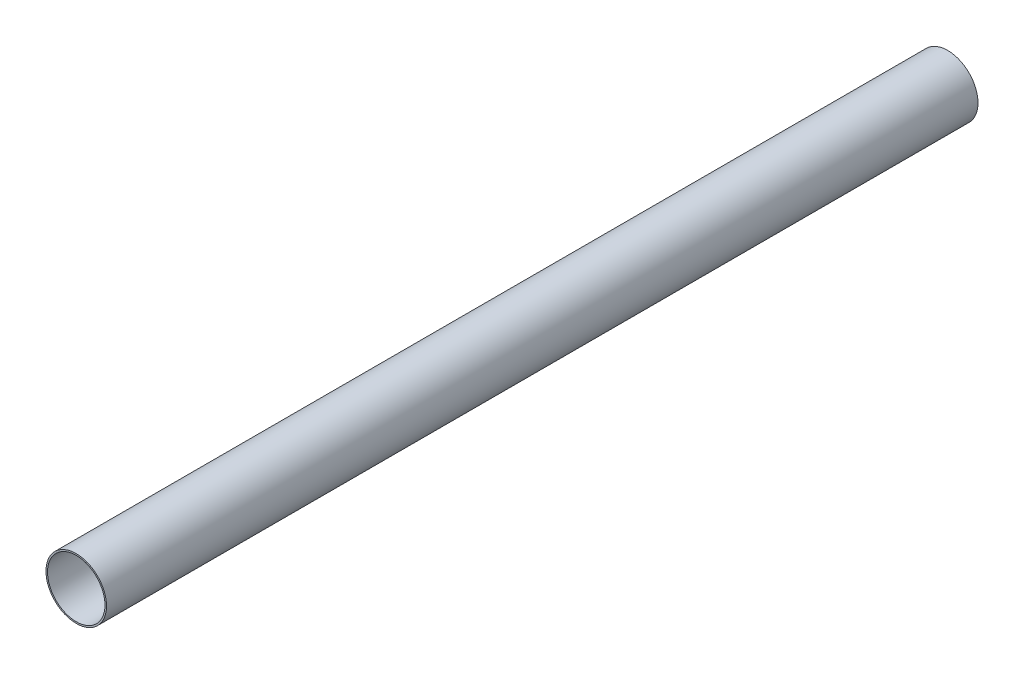
ISO-10303-21;
HEADER;
FILE_DESCRIPTION(('STEP AP214'),'2;1');
FILE_NAME('part.step','',(''),(''),'','','');
FILE_SCHEMA(('AUTOMOTIVE_DESIGN { 1 0 10303 214 1 1 1 1 }'));
ENDSEC;
DATA;
#1=APPLICATION_CONTEXT('core data for automotive mechanical design processes');
#2=APPLICATION_PROTOCOL_DEFINITION('international standard','automotive_design',2000,#1);
#3=PRODUCT_CONTEXT('',#1,'mechanical');
#4=PRODUCT('Part','Part','',(#3));
#5=PRODUCT_RELATED_PRODUCT_CATEGORY('part','',(#4));
#6=PRODUCT_DEFINITION_FORMATION('','',#4);
#7=PRODUCT_DEFINITION_CONTEXT('part definition',#1,'design');
#8=PRODUCT_DEFINITION('design','',#6,#7);
#9=PRODUCT_DEFINITION_SHAPE('','',#8);
#10=(LENGTH_UNIT() NAMED_UNIT(*) SI_UNIT(.MILLI.,.METRE.));
#11=(NAMED_UNIT(*) PLANE_ANGLE_UNIT() SI_UNIT($,.RADIAN.));
#12=(NAMED_UNIT(*) SI_UNIT($,.STERADIAN.) SOLID_ANGLE_UNIT());
#13=UNCERTAINTY_MEASURE_WITH_UNIT(LENGTH_MEASURE(1.E-05),#10,'distance_accuracy_value','');
#14=(GEOMETRIC_REPRESENTATION_CONTEXT(3) GLOBAL_UNCERTAINTY_ASSIGNED_CONTEXT((#13)) GLOBAL_UNIT_ASSIGNED_CONTEXT((#10,
#11,#12)) REPRESENTATION_CONTEXT('',''));
#15=CARTESIAN_POINT('',(0.,0.,0.));
#16=DIRECTION('',(0.,0.,1.));
#17=DIRECTION('',(1.,0.,0.));
#18=AXIS2_PLACEMENT_3D('',#15,#16,#17);
#19=CARTESIAN_POINT('',(0.,0.,1498.6));
#20=DIRECTION('',(0.,0.,1.));
#21=DIRECTION('',(1.,0.,0.));
#22=AXIS2_PLACEMENT_3D('',#19,#20,#21);
#23=PLANE('',#22);
#24=CARTESIAN_POINT('',(0.,0.,1498.6));
#25=DIRECTION('',(0.,0.,1.));
#26=DIRECTION('',(1.,0.,0.));
#27=AXIS2_PLACEMENT_3D('',#24,#25,#26);
#28=CIRCLE('',#27,52.07);
#29=CARTESIAN_POINT('',(52.07,0.,1498.6));
#30=VERTEX_POINT('',#29);
#31=EDGE_CURVE('E10',#30,#30,#28,.T.);
#32=ORIENTED_EDGE('',*,*,#31,.T.);
#33=EDGE_LOOP('',(#32));
#34=FACE_BOUND('',#33,.T.);
#35=CARTESIAN_POINT('',(0.,0.,1498.6));
#36=DIRECTION('',(0.,0.,1.));
#37=DIRECTION('',(1.,0.,0.));
#38=AXIS2_PLACEMENT_3D('',#35,#36,#37);
#39=CIRCLE('',#38,49.403);
#40=CARTESIAN_POINT('',(49.403,0.,1498.6));
#41=VERTEX_POINT('',#40);
#42=EDGE_CURVE('E52',#41,#41,#39,.T.);
#43=ORIENTED_EDGE('',*,*,#42,.F.);
#44=EDGE_LOOP('',(#43));
#45=FACE_BOUND('',#44,.T.);
#46=ADVANCED_FACE('F41',(#34,#45),#23,.T.);
#47=CARTESIAN_POINT('',(0.,0.,0.));
#48=DIRECTION('',(0.,0.,1.));
#49=DIRECTION('',(1.,0.,0.));
#50=AXIS2_PLACEMENT_3D('',#47,#48,#49);
#51=PLANE('',#50);
#52=CARTESIAN_POINT('',(0.,0.,0.));
#53=DIRECTION('',(0.,0.,1.));
#54=DIRECTION('',(1.,0.,0.));
#55=AXIS2_PLACEMENT_3D('',#52,#53,#54);
#56=CIRCLE('',#55,52.07);
#57=CARTESIAN_POINT('',(52.07,0.,0.));
#58=VERTEX_POINT('',#57);
#59=EDGE_CURVE('E45',#58,#58,#56,.T.);
#60=ORIENTED_EDGE('',*,*,#59,.F.);
#61=EDGE_LOOP('',(#60));
#62=FACE_BOUND('',#61,.T.);
#63=CARTESIAN_POINT('',(0.,0.,0.));
#64=DIRECTION('',(0.,0.,1.));
#65=DIRECTION('',(1.,0.,0.));
#66=AXIS2_PLACEMENT_3D('',#63,#64,#65);
#67=CIRCLE('',#66,49.403);
#68=CARTESIAN_POINT('',(49.403,0.,0.));
#69=VERTEX_POINT('',#68);
#70=EDGE_CURVE('E54',#69,#69,#67,.T.);
#71=ORIENTED_EDGE('',*,*,#70,.T.);
#72=EDGE_LOOP('',(#71));
#73=FACE_BOUND('',#72,.T.);
#74=ADVANCED_FACE('F64',(#62,#73),#51,.F.);
#75=CARTESIAN_POINT('',(0.,0.,1498.6));
#76=DIRECTION('',(0.,0.,-1.));
#77=DIRECTION('',(-1.,0.,0.));
#78=AXIS2_PLACEMENT_3D('',#75,#76,#77);
#79=CYLINDRICAL_SURFACE('',#78,52.07);
#80=ORIENTED_EDGE('',*,*,#31,.F.);
#81=EDGE_LOOP('',(#80));
#82=FACE_BOUND('',#81,.T.);
#83=ORIENTED_EDGE('',*,*,#59,.T.);
#84=EDGE_LOOP('',(#83));
#85=FACE_BOUND('',#84,.T.);
#86=ADVANCED_FACE('F43',(#82,#85),#79,.T.);
#87=CARTESIAN_POINT('',(0.,0.,1498.6));
#88=DIRECTION('',(0.,0.,-1.));
#89=DIRECTION('',(-1.,0.,0.));
#90=AXIS2_PLACEMENT_3D('',#87,#88,#89);
#91=CYLINDRICAL_SURFACE('',#90,49.403);
#92=ORIENTED_EDGE('',*,*,#42,.T.);
#93=EDGE_LOOP('',(#92));
#94=FACE_BOUND('',#93,.T.);
#95=ORIENTED_EDGE('',*,*,#70,.F.);
#96=EDGE_LOOP('',(#95));
#97=FACE_BOUND('',#96,.T.);
#98=ADVANCED_FACE('F60',(#94,#97),#91,.F.);
#99=CLOSED_SHELL('',(#46,#74,#86,#98));
#100=MANIFOLD_SOLID_BREP('B2',#99);
#101=ADVANCED_BREP_SHAPE_REPRESENTATION('',(#18,#100),#14);
#102=SHAPE_DEFINITION_REPRESENTATION(#9,#101);
ENDSEC;
END-ISO-10303-21;
